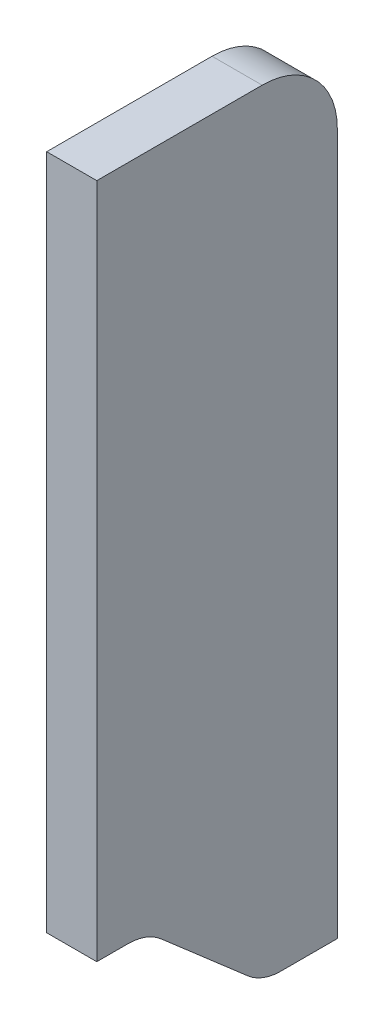
ISO-10303-21;
HEADER;
FILE_DESCRIPTION(('STEP AP214'),'2;1');
FILE_NAME('part.step','',(''),(''),'','','');
FILE_SCHEMA(('AUTOMOTIVE_DESIGN { 1 0 10303 214 1 1 1 1 }'));
ENDSEC;
DATA;
#1=APPLICATION_CONTEXT('core data for automotive mechanical design processes');
#2=APPLICATION_PROTOCOL_DEFINITION('international standard','automotive_design',2000,#1);
#3=PRODUCT_CONTEXT('',#1,'mechanical');
#4=PRODUCT('Part','Part','',(#3));
#5=PRODUCT_RELATED_PRODUCT_CATEGORY('part','',(#4));
#6=PRODUCT_DEFINITION_FORMATION('','',#4);
#7=PRODUCT_DEFINITION_CONTEXT('part definition',#1,'design');
#8=PRODUCT_DEFINITION('design','',#6,#7);
#9=PRODUCT_DEFINITION_SHAPE('','',#8);
#10=(LENGTH_UNIT() NAMED_UNIT(*) SI_UNIT(.MILLI.,.METRE.));
#11=(NAMED_UNIT(*) PLANE_ANGLE_UNIT() SI_UNIT($,.RADIAN.));
#12=(NAMED_UNIT(*) SI_UNIT($,.STERADIAN.) SOLID_ANGLE_UNIT());
#13=UNCERTAINTY_MEASURE_WITH_UNIT(LENGTH_MEASURE(1.E-05),#10,'distance_accuracy_value','');
#14=(GEOMETRIC_REPRESENTATION_CONTEXT(3) GLOBAL_UNCERTAINTY_ASSIGNED_CONTEXT((#13)) GLOBAL_UNIT_ASSIGNED_CONTEXT((#10,
#11,#12)) REPRESENTATION_CONTEXT('',''));
#15=CARTESIAN_POINT('',(0.,0.,0.));
#16=DIRECTION('',(0.,0.,1.));
#17=DIRECTION('',(1.,0.,0.));
#18=AXIS2_PLACEMENT_3D('',#15,#16,#17);
#19=CARTESIAN_POINT('',(-48.,-27.5,0.));
#20=DIRECTION('',(0.,1.,0.));
#21=DIRECTION('',(0.,0.,1.));
#22=AXIS2_PLACEMENT_3D('',#19,#20,#21);
#23=PLANE('',#22);
#24=DIRECTION('',(0.,0.,1.));
#25=VECTOR('',#24,1.);
#26=CARTESIAN_POINT('',(-38.,-27.5,0.));
#27=LINE('',#26,#25);
#28=CARTESIAN_POINT('',(-38.,-27.5,0.));
#29=VERTEX_POINT('',#28);
#30=CARTESIAN_POINT('',(-38.,-27.5,11.2602493458718));
#31=VERTEX_POINT('',#30);
#32=EDGE_CURVE('E140',#29,#31,#27,.T.);
#33=ORIENTED_EDGE('',*,*,#32,.T.);
#34=DIRECTION('',(1.,0.,0.));
#35=VECTOR('',#34,1.);
#36=CARTESIAN_POINT('',(-48.,-27.5,11.2602493458718));
#37=LINE('',#36,#35);
#38=CARTESIAN_POINT('',(-48.,-27.5,11.2602493458718));
#39=VERTEX_POINT('',#38);
#40=EDGE_CURVE('E165',#31,#39,#37,.F.);
#41=ORIENTED_EDGE('',*,*,#40,.T.);
#42=DIRECTION('',(0.,0.,1.));
#43=VECTOR('',#42,1.);
#44=CARTESIAN_POINT('',(-48.,-27.5,0.));
#45=LINE('',#44,#43);
#46=CARTESIAN_POINT('',(-48.,-27.5,0.));
#47=VERTEX_POINT('',#46);
#48=EDGE_CURVE('E153',#47,#39,#45,.T.);
#49=ORIENTED_EDGE('',*,*,#48,.F.);
#50=DIRECTION('',(1.,0.,0.));
#51=VECTOR('',#50,1.);
#52=CARTESIAN_POINT('',(-48.,-27.5,0.));
#53=LINE('',#52,#51);
#54=EDGE_CURVE('E139',#47,#29,#53,.T.);
#55=ORIENTED_EDGE('',*,*,#54,.T.);
#56=EDGE_LOOP('',(#33,#41,#49,#55));
#57=FACE_BOUND('',#56,.T.);
#58=ADVANCED_FACE('F36',(#57),#23,.F.);
#59=CARTESIAN_POINT('',(-48.,-27.5,15.));
#60=DIRECTION('',(0.,0.754605522163505,-0.656178714924787));
#61=DIRECTION('',(0.,0.656178714924787,0.754605522163505));
#62=AXIS2_PLACEMENT_3D('',#59,#60,#61);
#63=PLANE('',#62);
#64=DIRECTION('',(0.,0.656178714924787,0.754605522163505));
#65=VECTOR('',#64,1.);
#66=CARTESIAN_POINT('',(-38.,-27.5,15.));
#67=LINE('',#66,#65);
#68=CARTESIAN_POINT('',(-38.,-25.046055221635,17.8220364951197));
#69=VERTEX_POINT('',#68);
#70=CARTESIAN_POINT('',(-38.,-9.95394477836495,35.1779635048803));
#71=VERTEX_POINT('',#70);
#72=EDGE_CURVE('E143',#69,#71,#67,.T.);
#73=ORIENTED_EDGE('',*,*,#72,.T.);
#74=DIRECTION('',(1.,0.,0.));
#75=VECTOR('',#74,1.);
#76=CARTESIAN_POINT('',(-48.,-9.95394477836495,35.1779635048803));
#77=LINE('',#76,#75);
#78=CARTESIAN_POINT('',(-48.,-9.95394477836495,35.1779635048803));
#79=VERTEX_POINT('',#78);
#80=EDGE_CURVE('E161',#71,#79,#77,.F.);
#81=ORIENTED_EDGE('',*,*,#80,.T.);
#82=DIRECTION('',(0.,0.656178714924787,0.754605522163505));
#83=VECTOR('',#82,1.);
#84=CARTESIAN_POINT('',(-48.,-27.5,15.));
#85=LINE('',#84,#83);
#86=CARTESIAN_POINT('',(-48.,-25.046055221635,17.8220364951197));
#87=VERTEX_POINT('',#86);
#88=EDGE_CURVE('E118',#87,#79,#85,.T.);
#89=ORIENTED_EDGE('',*,*,#88,.F.);
#90=DIRECTION('',(1.,0.,0.));
#91=VECTOR('',#90,1.);
#92=CARTESIAN_POINT('',(-48.,-25.046055221635,17.8220364951197));
#93=LINE('',#92,#91);
#94=EDGE_CURVE('E158',#87,#69,#93,.T.);
#95=ORIENTED_EDGE('',*,*,#94,.T.);
#96=EDGE_LOOP('',(#73,#81,#89,#95));
#97=FACE_BOUND('',#96,.T.);
#98=ADVANCED_FACE('F195',(#97),#63,.F.);
#99=CARTESIAN_POINT('',(-48.,-7.5,38.));
#100=DIRECTION('',(0.,1.,0.));
#101=DIRECTION('',(0.,0.,1.));
#102=AXIS2_PLACEMENT_3D('',#99,#100,#101);
#103=PLANE('',#102);
#104=DIRECTION('',(0.,0.,1.));
#105=VECTOR('',#104,1.);
#106=CARTESIAN_POINT('',(-48.,-7.5,38.));
#107=LINE('',#106,#105);
#108=CARTESIAN_POINT('',(-48.,-7.5,41.7397506541282));
#109=VERTEX_POINT('',#108);
#110=CARTESIAN_POINT('',(-48.,-7.5,48.));
#111=VERTEX_POINT('',#110);
#112=EDGE_CURVE('E106',#109,#111,#107,.T.);
#113=ORIENTED_EDGE('',*,*,#112,.F.);
#114=DIRECTION('',(1.,0.,0.));
#115=VECTOR('',#114,1.);
#116=CARTESIAN_POINT('',(-38.,-7.5,41.7397506541282));
#117=LINE('',#116,#115);
#118=CARTESIAN_POINT('',(-38.,-7.5,41.7397506541282));
#119=VERTEX_POINT('',#118);
#120=EDGE_CURVE('E127',#109,#119,#117,.T.);
#121=ORIENTED_EDGE('',*,*,#120,.T.);
#122=DIRECTION('',(0.,0.,1.));
#123=VECTOR('',#122,1.);
#124=CARTESIAN_POINT('',(-38.,-7.5,38.));
#125=LINE('',#124,#123);
#126=CARTESIAN_POINT('',(-38.,-7.5,48.));
#127=VERTEX_POINT('',#126);
#128=EDGE_CURVE('E124',#119,#127,#125,.T.);
#129=ORIENTED_EDGE('',*,*,#128,.T.);
#130=DIRECTION('',(1.,0.,0.));
#131=VECTOR('',#130,1.);
#132=CARTESIAN_POINT('',(-48.,-7.5,48.));
#133=LINE('',#132,#131);
#134=EDGE_CURVE('E121',#111,#127,#133,.T.);
#135=ORIENTED_EDGE('',*,*,#134,.F.);
#136=EDGE_LOOP('',(#113,#121,#129,#135));
#137=FACE_BOUND('',#136,.T.);
#138=ADVANCED_FACE('F122',(#137),#103,.F.);
#139=CARTESIAN_POINT('',(-48.,-7.5,48.));
#140=DIRECTION('',(0.,0.,-1.));
#141=DIRECTION('',(-1.,0.,0.));
#142=AXIS2_PLACEMENT_3D('',#139,#140,#141);
#143=PLANE('',#142);
#144=DIRECTION('',(0.,1.,0.));
#145=VECTOR('',#144,1.);
#146=CARTESIAN_POINT('',(-38.,-7.5,48.));
#147=LINE('',#146,#145);
#148=CARTESIAN_POINT('',(-38.,127.5,48.));
#149=VERTEX_POINT('',#148);
#150=EDGE_CURVE('E147',#127,#149,#147,.T.);
#151=ORIENTED_EDGE('',*,*,#150,.T.);
#152=DIRECTION('',(1.,0.,0.));
#153=VECTOR('',#152,1.);
#154=CARTESIAN_POINT('',(-48.,127.5,48.));
#155=LINE('',#154,#153);
#156=CARTESIAN_POINT('',(-48.,127.5,48.));
#157=VERTEX_POINT('',#156);
#158=EDGE_CURVE('E128',#157,#149,#155,.T.);
#159=ORIENTED_EDGE('',*,*,#158,.F.);
#160=DIRECTION('',(0.,1.,0.));
#161=VECTOR('',#160,1.);
#162=CARTESIAN_POINT('',(-48.,-7.5,48.));
#163=LINE('',#162,#161);
#164=EDGE_CURVE('E110',#111,#157,#163,.T.);
#165=ORIENTED_EDGE('',*,*,#164,.F.);
#166=ORIENTED_EDGE('',*,*,#134,.T.);
#167=EDGE_LOOP('',(#151,#159,#165,#166));
#168=FACE_BOUND('',#167,.T.);
#169=ADVANCED_FACE('F130',(#168),#143,.F.);
#170=CARTESIAN_POINT('',(-48.,127.5,48.));
#171=DIRECTION('',(0.,-1.,0.));
#172=DIRECTION('',(0.,0.,-1.));
#173=AXIS2_PLACEMENT_3D('',#170,#171,#172);
#174=PLANE('',#173);
#175=DIRECTION('',(0.,0.,-1.));
#176=VECTOR('',#175,1.);
#177=CARTESIAN_POINT('',(-38.,127.5,48.));
#178=LINE('',#177,#176);
#179=CARTESIAN_POINT('',(-38.,127.5,15.));
#180=VERTEX_POINT('',#179);
#181=EDGE_CURVE('E149',#149,#180,#178,.T.);
#182=ORIENTED_EDGE('',*,*,#181,.T.);
#183=DIRECTION('',(1.,0.,0.));
#184=VECTOR('',#183,1.);
#185=CARTESIAN_POINT('',(-48.,127.5,15.));
#186=LINE('',#185,#184);
#187=CARTESIAN_POINT('',(-48.,127.5,15.));
#188=VERTEX_POINT('',#187);
#189=EDGE_CURVE('E44',#180,#188,#186,.F.);
#190=ORIENTED_EDGE('',*,*,#189,.T.);
#191=DIRECTION('',(0.,0.,-1.));
#192=VECTOR('',#191,1.);
#193=CARTESIAN_POINT('',(-48.,127.5,48.));
#194=LINE('',#193,#192);
#195=EDGE_CURVE('E132',#157,#188,#194,.T.);
#196=ORIENTED_EDGE('',*,*,#195,.F.);
#197=ORIENTED_EDGE('',*,*,#158,.T.);
#198=EDGE_LOOP('',(#182,#190,#196,#197));
#199=FACE_BOUND('',#198,.T.);
#200=ADVANCED_FACE('F200',(#199),#174,.F.);
#201=CARTESIAN_POINT('',(-48.,-27.5,0.));
#202=DIRECTION('',(0.,0.,1.));
#203=DIRECTION('',(1.,0.,0.));
#204=AXIS2_PLACEMENT_3D('',#201,#202,#203);
#205=PLANE('',#204);
#206=DIRECTION('',(0.,-1.,0.));
#207=VECTOR('',#206,1.);
#208=CARTESIAN_POINT('',(-48.,-27.5,0.));
#209=LINE('',#208,#207);
#210=CARTESIAN_POINT('',(-48.,112.5,0.));
#211=VERTEX_POINT('',#210);
#212=EDGE_CURVE('E134',#211,#47,#209,.T.);
#213=ORIENTED_EDGE('',*,*,#212,.F.);
#214=DIRECTION('',(1.,0.,0.));
#215=VECTOR('',#214,1.);
#216=CARTESIAN_POINT('',(-48.,112.5,0.));
#217=LINE('',#216,#215);
#218=CARTESIAN_POINT('',(-38.,112.5,0.));
#219=VERTEX_POINT('',#218);
#220=EDGE_CURVE('E172',#211,#219,#217,.T.);
#221=ORIENTED_EDGE('',*,*,#220,.T.);
#222=DIRECTION('',(0.,-1.,0.));
#223=VECTOR('',#222,1.);
#224=CARTESIAN_POINT('',(-38.,-27.5,0.));
#225=LINE('',#224,#223);
#226=EDGE_CURVE('E151',#219,#29,#225,.T.);
#227=ORIENTED_EDGE('',*,*,#226,.T.);
#228=ORIENTED_EDGE('',*,*,#54,.F.);
#229=EDGE_LOOP('',(#213,#221,#227,#228));
#230=FACE_BOUND('',#229,.T.);
#231=ADVANCED_FACE('F178',(#230),#205,.F.);
#232=CARTESIAN_POINT('',(-48.,0.,0.));
#233=DIRECTION('',(-1.,0.,0.));
#234=DIRECTION('',(0.,0.,1.));
#235=AXIS2_PLACEMENT_3D('',#232,#233,#234);
#236=PLANE('',#235);
#237=ORIENTED_EDGE('',*,*,#195,.T.);
#238=CARTESIAN_POINT('',(-48.,112.5,15.));
#239=DIRECTION('',(-1.,0.,0.));
#240=DIRECTION('',(0.,0.,1.));
#241=AXIS2_PLACEMENT_3D('',#238,#239,#240);
#242=CIRCLE('',#241,15.);
#243=EDGE_CURVE('E11',#188,#211,#242,.T.);
#244=ORIENTED_EDGE('',*,*,#243,.T.);
#245=ORIENTED_EDGE('',*,*,#212,.T.);
#246=ORIENTED_EDGE('',*,*,#48,.T.);
#247=CARTESIAN_POINT('',(-48.,-17.5,11.2602493458718));
#248=DIRECTION('',(-1.,0.,0.));
#249=DIRECTION('',(0.,0.,1.));
#250=AXIS2_PLACEMENT_3D('',#247,#248,#249);
#251=CIRCLE('',#250,10.);
#252=EDGE_CURVE('E167',#39,#87,#251,.T.);
#253=ORIENTED_EDGE('',*,*,#252,.T.);
#254=ORIENTED_EDGE('',*,*,#88,.T.);
#255=CARTESIAN_POINT('',(-48.,-17.5,41.7397506541282));
#256=DIRECTION('',(-1.,0.,0.));
#257=DIRECTION('',(0.,0.,1.));
#258=AXIS2_PLACEMENT_3D('',#255,#256,#257);
#259=CIRCLE('',#258,10.);
#260=EDGE_CURVE('E114',#79,#109,#259,.F.);
#261=ORIENTED_EDGE('',*,*,#260,.T.);
#262=ORIENTED_EDGE('',*,*,#112,.T.);
#263=ORIENTED_EDGE('',*,*,#164,.T.);
#264=EDGE_LOOP('',(#237,#244,#245,#246,#253,#254,#261,#262,#263));
#265=FACE_BOUND('',#264,.T.);
#266=ADVANCED_FACE('F108',(#265),#236,.T.);
#267=CARTESIAN_POINT('',(-38.,0.,0.));
#268=DIRECTION('',(-1.,0.,0.));
#269=DIRECTION('',(0.,0.,1.));
#270=AXIS2_PLACEMENT_3D('',#267,#268,#269);
#271=PLANE('',#270);
#272=ORIENTED_EDGE('',*,*,#226,.F.);
#273=CARTESIAN_POINT('',(-38.,112.5,15.));
#274=DIRECTION('',(-1.,0.,0.));
#275=DIRECTION('',(0.,0.,1.));
#276=AXIS2_PLACEMENT_3D('',#273,#274,#275);
#277=CIRCLE('',#276,15.);
#278=EDGE_CURVE('E58',#219,#180,#277,.F.);
#279=ORIENTED_EDGE('',*,*,#278,.T.);
#280=ORIENTED_EDGE('',*,*,#181,.F.);
#281=ORIENTED_EDGE('',*,*,#150,.F.);
#282=ORIENTED_EDGE('',*,*,#128,.F.);
#283=CARTESIAN_POINT('',(-38.,-17.5,41.7397506541282));
#284=DIRECTION('',(-1.,0.,0.));
#285=DIRECTION('',(0.,0.,1.));
#286=AXIS2_PLACEMENT_3D('',#283,#284,#285);
#287=CIRCLE('',#286,10.);
#288=EDGE_CURVE('E169',#119,#71,#287,.T.);
#289=ORIENTED_EDGE('',*,*,#288,.T.);
#290=ORIENTED_EDGE('',*,*,#72,.F.);
#291=CARTESIAN_POINT('',(-38.,-17.5,11.2602493458718));
#292=DIRECTION('',(-1.,0.,0.));
#293=DIRECTION('',(0.,0.,1.));
#294=AXIS2_PLACEMENT_3D('',#291,#292,#293);
#295=CIRCLE('',#294,10.);
#296=EDGE_CURVE('E163',#69,#31,#295,.F.);
#297=ORIENTED_EDGE('',*,*,#296,.T.);
#298=ORIENTED_EDGE('',*,*,#32,.F.);
#299=EDGE_LOOP('',(#272,#279,#280,#281,#282,#289,#290,#297,#298));
#300=FACE_BOUND('',#299,.T.);
#301=ADVANCED_FACE('F183',(#300),#271,.F.);
#302=CARTESIAN_POINT('',(-48.,-17.5,41.7397506541282));
#303=DIRECTION('',(-1.,0.,0.));
#304=DIRECTION('',(0.,0.,1.));
#305=AXIS2_PLACEMENT_3D('',#302,#303,#304);
#306=CYLINDRICAL_SURFACE('',#305,10.);
#307=ORIENTED_EDGE('',*,*,#260,.F.);
#308=ORIENTED_EDGE('',*,*,#80,.F.);
#309=ORIENTED_EDGE('',*,*,#288,.F.);
#310=ORIENTED_EDGE('',*,*,#120,.F.);
#311=EDGE_LOOP('',(#307,#308,#309,#310));
#312=FACE_BOUND('',#311,.T.);
#313=ADVANCED_FACE('F199',(#312),#306,.F.);
#314=CARTESIAN_POINT('',(-48.,-17.5,11.2602493458718));
#315=DIRECTION('',(1.,0.,0.));
#316=DIRECTION('',(0.,0.,-1.));
#317=AXIS2_PLACEMENT_3D('',#314,#315,#316);
#318=CYLINDRICAL_SURFACE('',#317,10.);
#319=ORIENTED_EDGE('',*,*,#252,.F.);
#320=ORIENTED_EDGE('',*,*,#40,.F.);
#321=ORIENTED_EDGE('',*,*,#296,.F.);
#322=ORIENTED_EDGE('',*,*,#94,.F.);
#323=EDGE_LOOP('',(#319,#320,#321,#322));
#324=FACE_BOUND('',#323,.T.);
#325=ADVANCED_FACE('F191',(#324),#318,.T.);
#326=CARTESIAN_POINT('',(-48.,112.5,15.));
#327=DIRECTION('',(1.,0.,0.));
#328=DIRECTION('',(0.,0.,-1.));
#329=AXIS2_PLACEMENT_3D('',#326,#327,#328);
#330=CYLINDRICAL_SURFACE('',#329,15.);
#331=ORIENTED_EDGE('',*,*,#243,.F.);
#332=ORIENTED_EDGE('',*,*,#189,.F.);
#333=ORIENTED_EDGE('',*,*,#278,.F.);
#334=ORIENTED_EDGE('',*,*,#220,.F.);
#335=EDGE_LOOP('',(#331,#332,#333,#334));
#336=FACE_BOUND('',#335,.T.);
#337=ADVANCED_FACE('F38',(#336),#330,.T.);
#338=CLOSED_SHELL('',(#58,#98,#138,#169,#200,#231,#266,#301,#313,#325,#337));
#339=MANIFOLD_SOLID_BREP('B2',#338);
#340=ADVANCED_BREP_SHAPE_REPRESENTATION('',(#18,#339),#14);
#341=SHAPE_DEFINITION_REPRESENTATION(#9,#340);
ENDSEC;
END-ISO-10303-21;
